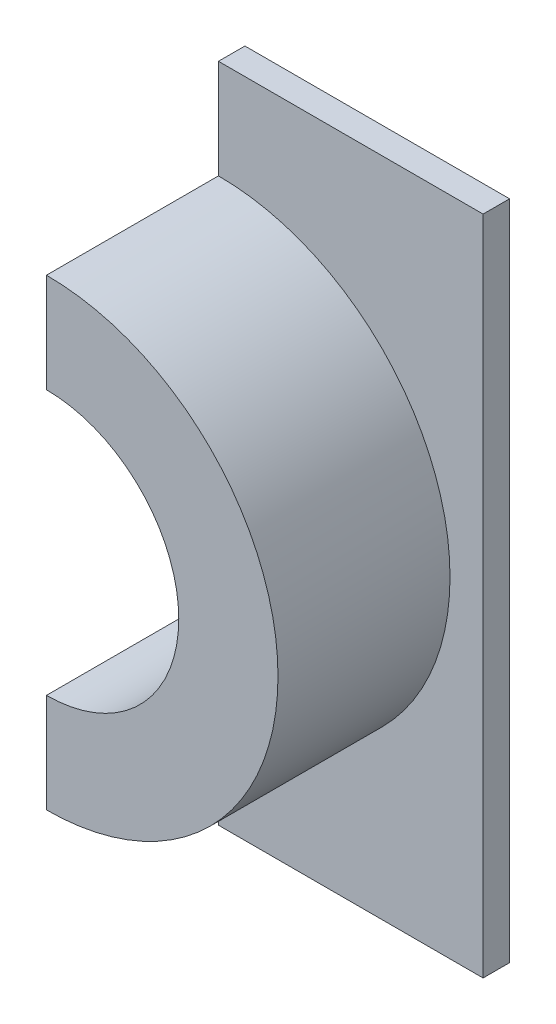
ISO-10303-21;
HEADER;
FILE_DESCRIPTION(('STEP AP214'),'2;1');
FILE_NAME('part.step','',(''),(''),'','','');
FILE_SCHEMA(('AUTOMOTIVE_DESIGN { 1 0 10303 214 1 1 1 1 }'));
ENDSEC;
DATA;
#1=APPLICATION_CONTEXT('core data for automotive mechanical design processes');
#2=APPLICATION_PROTOCOL_DEFINITION('international standard','automotive_design',2000,#1);
#3=PRODUCT_CONTEXT('',#1,'mechanical');
#4=PRODUCT('Part','Part','',(#3));
#5=PRODUCT_RELATED_PRODUCT_CATEGORY('part','',(#4));
#6=PRODUCT_DEFINITION_FORMATION('','',#4);
#7=PRODUCT_DEFINITION_CONTEXT('part definition',#1,'design');
#8=PRODUCT_DEFINITION('design','',#6,#7);
#9=PRODUCT_DEFINITION_SHAPE('','',#8);
#10=(LENGTH_UNIT() NAMED_UNIT(*) SI_UNIT(.MILLI.,.METRE.));
#11=(NAMED_UNIT(*) PLANE_ANGLE_UNIT() SI_UNIT($,.RADIAN.));
#12=(NAMED_UNIT(*) SI_UNIT($,.STERADIAN.) SOLID_ANGLE_UNIT());
#13=UNCERTAINTY_MEASURE_WITH_UNIT(LENGTH_MEASURE(1.E-05),#10,'distance_accuracy_value','');
#14=(GEOMETRIC_REPRESENTATION_CONTEXT(3) GLOBAL_UNCERTAINTY_ASSIGNED_CONTEXT((#13)) GLOBAL_UNIT_ASSIGNED_CONTEXT((#10,
#11,#12)) REPRESENTATION_CONTEXT('',''));
#15=CARTESIAN_POINT('',(0.,0.,0.));
#16=DIRECTION('',(0.,0.,1.));
#17=DIRECTION('',(1.,0.,0.));
#18=AXIS2_PLACEMENT_3D('',#15,#16,#17);
#19=CARTESIAN_POINT('',(-0.2,0.,0.04));
#20=DIRECTION('',(0.,0.,-1.));
#21=DIRECTION('',(-1.,0.,0.));
#22=AXIS2_PLACEMENT_3D('',#19,#20,#21);
#23=CYLINDRICAL_SURFACE('',#22,0.35);
#24=CARTESIAN_POINT('',(-0.2,0.,0.04));
#25=DIRECTION('',(0.,0.,-1.));
#26=DIRECTION('',(-1.,0.,0.));
#27=AXIS2_PLACEMENT_3D('',#24,#25,#26);
#28=CIRCLE('',#27,0.35);
#29=CARTESIAN_POINT('',(-0.2,0.35,0.04));
#30=VERTEX_POINT('',#29);
#31=CARTESIAN_POINT('',(-0.2,-0.35,0.04));
#32=VERTEX_POINT('',#31);
#33=EDGE_CURVE('E19',#30,#32,#28,.T.);
#34=ORIENTED_EDGE('',*,*,#33,.F.);
#35=DIRECTION('',(0.,0.,-1.));
#36=VECTOR('',#35,1.);
#37=CARTESIAN_POINT('',(-0.2,0.35,0.3));
#38=LINE('',#37,#36);
#39=CARTESIAN_POINT('',(-0.2,0.35,0.3));
#40=VERTEX_POINT('',#39);
#41=EDGE_CURVE('E116',#30,#40,#38,.F.);
#42=ORIENTED_EDGE('',*,*,#41,.T.);
#43=CARTESIAN_POINT('',(-0.2,0.,0.3));
#44=DIRECTION('',(0.,0.,-1.));
#45=DIRECTION('',(-1.,0.,0.));
#46=AXIS2_PLACEMENT_3D('',#43,#44,#45);
#47=CIRCLE('',#46,0.35);
#48=CARTESIAN_POINT('',(-0.2,-0.35,0.3));
#49=VERTEX_POINT('',#48);
#50=EDGE_CURVE('E93',#49,#40,#47,.F.);
#51=ORIENTED_EDGE('',*,*,#50,.F.);
#52=DIRECTION('',(0.,0.,-1.));
#53=VECTOR('',#52,1.);
#54=CARTESIAN_POINT('',(-0.2,-0.35,0.3));
#55=LINE('',#54,#53);
#56=EDGE_CURVE('E95',#49,#32,#55,.T.);
#57=ORIENTED_EDGE('',*,*,#56,.T.);
#58=EDGE_LOOP('',(#34,#42,#51,#57));
#59=FACE_BOUND('',#58,.T.);
#60=ADVANCED_FACE('F16',(#59),#23,.T.);
#61=CARTESIAN_POINT('',(-0.2,-0.5,0.04));
#62=DIRECTION('',(0.,0.,1.));
#63=DIRECTION('',(1.,0.,0.));
#64=AXIS2_PLACEMENT_3D('',#61,#62,#63);
#65=PLANE('',#64);
#66=DIRECTION('',(0.,1.,0.));
#67=VECTOR('',#66,1.);
#68=CARTESIAN_POINT('',(-0.2,0.35,0.04));
#69=LINE('',#68,#67);
#70=CARTESIAN_POINT('',(-0.2,-0.5,0.04));
#71=VERTEX_POINT('',#70);
#72=EDGE_CURVE('E91',#32,#71,#69,.F.);
#73=ORIENTED_EDGE('',*,*,#72,.T.);
#74=DIRECTION('',(1.,0.,0.));
#75=VECTOR('',#74,1.);
#76=CARTESIAN_POINT('',(-0.2,-0.5,0.04));
#77=LINE('',#76,#75);
#78=CARTESIAN_POINT('',(0.2,-0.5,0.04));
#79=VERTEX_POINT('',#78);
#80=EDGE_CURVE('E86',#71,#79,#77,.T.);
#81=ORIENTED_EDGE('',*,*,#80,.T.);
#82=DIRECTION('',(0.,1.,0.));
#83=VECTOR('',#82,1.);
#84=CARTESIAN_POINT('',(0.2,-0.35,0.04));
#85=LINE('',#84,#83);
#86=CARTESIAN_POINT('',(0.2,0.5,0.04));
#87=VERTEX_POINT('',#86);
#88=EDGE_CURVE('E126',#79,#87,#85,.T.);
#89=ORIENTED_EDGE('',*,*,#88,.T.);
#90=DIRECTION('',(1.,0.,0.));
#91=VECTOR('',#90,1.);
#92=CARTESIAN_POINT('',(0.2,0.5,0.04));
#93=LINE('',#92,#91);
#94=CARTESIAN_POINT('',(-0.2,0.5,0.04));
#95=VERTEX_POINT('',#94);
#96=EDGE_CURVE('E68',#87,#95,#93,.F.);
#97=ORIENTED_EDGE('',*,*,#96,.T.);
#98=DIRECTION('',(0.,1.,0.));
#99=VECTOR('',#98,1.);
#100=CARTESIAN_POINT('',(-0.2,0.35,0.04));
#101=LINE('',#100,#99);
#102=EDGE_CURVE('E92',#95,#30,#101,.F.);
#103=ORIENTED_EDGE('',*,*,#102,.T.);
#104=ORIENTED_EDGE('',*,*,#33,.T.);
#105=EDGE_LOOP('',(#73,#81,#89,#97,#103,#104));
#106=FACE_BOUND('',#105,.T.);
#107=ADVANCED_FACE('F90',(#106),#65,.T.);
#108=CARTESIAN_POINT('',(-0.2,-0.35,0.3));
#109=DIRECTION('',(0.,0.,1.));
#110=DIRECTION('',(1.,0.,0.));
#111=AXIS2_PLACEMENT_3D('',#108,#109,#110);
#112=PLANE('',#111);
#113=CARTESIAN_POINT('',(-0.2,0.,0.3));
#114=DIRECTION('',(0.,0.,1.));
#115=DIRECTION('',(1.,0.,0.));
#116=AXIS2_PLACEMENT_3D('',#113,#114,#115);
#117=CIRCLE('',#116,0.2);
#118=CARTESIAN_POINT('',(-0.2,0.2,0.3));
#119=VERTEX_POINT('',#118);
#120=CARTESIAN_POINT('',(-0.2,-0.2,0.3));
#121=VERTEX_POINT('',#120);
#122=EDGE_CURVE('E100',#119,#121,#117,.F.);
#123=ORIENTED_EDGE('',*,*,#122,.T.);
#124=DIRECTION('',(0.,1.,0.));
#125=VECTOR('',#124,1.);
#126=CARTESIAN_POINT('',(-0.2,0.35,0.3));
#127=LINE('',#126,#125);
#128=EDGE_CURVE('E106',#121,#49,#127,.F.);
#129=ORIENTED_EDGE('',*,*,#128,.T.);
#130=ORIENTED_EDGE('',*,*,#50,.T.);
#131=DIRECTION('',(0.,1.,0.));
#132=VECTOR('',#131,1.);
#133=CARTESIAN_POINT('',(-0.2,0.35,0.3));
#134=LINE('',#133,#132);
#135=EDGE_CURVE('E114',#40,#119,#134,.F.);
#136=ORIENTED_EDGE('',*,*,#135,.T.);
#137=EDGE_LOOP('',(#123,#129,#130,#136));
#138=FACE_BOUND('',#137,.T.);
#139=ADVANCED_FACE('F134',(#138),#112,.T.);
#140=CARTESIAN_POINT('',(-0.2,-0.5,0.04));
#141=DIRECTION('',(0.,1.,0.));
#142=DIRECTION('',(0.,0.,1.));
#143=AXIS2_PLACEMENT_3D('',#140,#141,#142);
#144=PLANE('',#143);
#145=DIRECTION('',(0.,0.,1.));
#146=VECTOR('',#145,1.);
#147=CARTESIAN_POINT('',(0.2,-0.5,0.3));
#148=LINE('',#147,#146);
#149=CARTESIAN_POINT('',(0.2,-0.5,0.));
#150=VERTEX_POINT('',#149);
#151=EDGE_CURVE('E109',#150,#79,#148,.T.);
#152=ORIENTED_EDGE('',*,*,#151,.T.);
#153=ORIENTED_EDGE('',*,*,#80,.F.);
#154=DIRECTION('',(0.,0.,-1.));
#155=VECTOR('',#154,1.);
#156=CARTESIAN_POINT('',(-0.2,-0.5,0.3));
#157=LINE('',#156,#155);
#158=CARTESIAN_POINT('',(-0.2,-0.5,0.));
#159=VERTEX_POINT('',#158);
#160=EDGE_CURVE('E97',#71,#159,#157,.T.);
#161=ORIENTED_EDGE('',*,*,#160,.T.);
#162=DIRECTION('',(1.,0.,0.));
#163=VECTOR('',#162,1.);
#164=CARTESIAN_POINT('',(-0.2,-0.5,0.));
#165=LINE('',#164,#163);
#166=EDGE_CURVE('E165',#159,#150,#165,.T.);
#167=ORIENTED_EDGE('',*,*,#166,.T.);
#168=EDGE_LOOP('',(#152,#153,#161,#167));
#169=FACE_BOUND('',#168,.T.);
#170=ADVANCED_FACE('F170',(#169),#144,.F.);
#171=CARTESIAN_POINT('',(0.2,-0.35,0.3));
#172=DIRECTION('',(-1.,0.,0.));
#173=DIRECTION('',(0.,0.,1.));
#174=AXIS2_PLACEMENT_3D('',#171,#172,#173);
#175=PLANE('',#174);
#176=ORIENTED_EDGE('',*,*,#88,.F.);
#177=ORIENTED_EDGE('',*,*,#151,.F.);
#178=DIRECTION('',(0.,1.,0.));
#179=VECTOR('',#178,1.);
#180=CARTESIAN_POINT('',(0.2,-0.35,0.));
#181=LINE('',#180,#179);
#182=CARTESIAN_POINT('',(0.2,0.5,0.));
#183=VERTEX_POINT('',#182);
#184=EDGE_CURVE('E156',#150,#183,#181,.T.);
#185=ORIENTED_EDGE('',*,*,#184,.T.);
#186=DIRECTION('',(0.,0.,-1.));
#187=VECTOR('',#186,1.);
#188=CARTESIAN_POINT('',(0.2,0.5,0.04));
#189=LINE('',#188,#187);
#190=EDGE_CURVE('E123',#183,#87,#189,.F.);
#191=ORIENTED_EDGE('',*,*,#190,.T.);
#192=EDGE_LOOP('',(#176,#177,#185,#191));
#193=FACE_BOUND('',#192,.T.);
#194=ADVANCED_FACE('F175',(#193),#175,.F.);
#195=CARTESIAN_POINT('',(0.2,0.5,0.04));
#196=DIRECTION('',(0.,-1.,0.));
#197=DIRECTION('',(0.,0.,-1.));
#198=AXIS2_PLACEMENT_3D('',#195,#196,#197);
#199=PLANE('',#198);
#200=DIRECTION('',(0.,0.,-1.));
#201=VECTOR('',#200,1.);
#202=CARTESIAN_POINT('',(-0.2,0.5,0.3));
#203=LINE('',#202,#201);
#204=CARTESIAN_POINT('',(-0.2,0.5,0.));
#205=VERTEX_POINT('',#204);
#206=EDGE_CURVE('E119',#205,#95,#203,.F.);
#207=ORIENTED_EDGE('',*,*,#206,.T.);
#208=ORIENTED_EDGE('',*,*,#96,.F.);
#209=ORIENTED_EDGE('',*,*,#190,.F.);
#210=DIRECTION('',(1.,0.,0.));
#211=VECTOR('',#210,1.);
#212=CARTESIAN_POINT('',(-0.2,0.5,0.));
#213=LINE('',#212,#211);
#214=EDGE_CURVE('E153',#183,#205,#213,.F.);
#215=ORIENTED_EDGE('',*,*,#214,.T.);
#216=EDGE_LOOP('',(#207,#208,#209,#215));
#217=FACE_BOUND('',#216,.T.);
#218=ADVANCED_FACE('F180',(#217),#199,.F.);
#219=CARTESIAN_POINT('',(-0.2,0.35,0.3));
#220=DIRECTION('',(1.,0.,0.));
#221=DIRECTION('',(0.,0.,-1.));
#222=AXIS2_PLACEMENT_3D('',#219,#220,#221);
#223=PLANE('',#222);
#224=DIRECTION('',(0.,0.,1.));
#225=VECTOR('',#224,1.);
#226=CARTESIAN_POINT('',(-0.2,0.2,1.20415945787923));
#227=LINE('',#226,#225);
#228=CARTESIAN_POINT('',(-0.2,0.2,0.));
#229=VERTEX_POINT('',#228);
#230=EDGE_CURVE('E102',#229,#119,#227,.T.);
#231=ORIENTED_EDGE('',*,*,#230,.T.);
#232=ORIENTED_EDGE('',*,*,#135,.F.);
#233=ORIENTED_EDGE('',*,*,#41,.F.);
#234=ORIENTED_EDGE('',*,*,#102,.F.);
#235=ORIENTED_EDGE('',*,*,#206,.F.);
#236=DIRECTION('',(0.,1.,0.));
#237=VECTOR('',#236,1.);
#238=CARTESIAN_POINT('',(-0.2,-0.35,0.));
#239=LINE('',#238,#237);
#240=EDGE_CURVE('E131',#205,#229,#239,.F.);
#241=ORIENTED_EDGE('',*,*,#240,.T.);
#242=EDGE_LOOP('',(#231,#232,#233,#234,#235,#241));
#243=FACE_BOUND('',#242,.T.);
#244=ADVANCED_FACE('F138',(#243),#223,.F.);
#245=CARTESIAN_POINT('',(-0.2,0.,1.20415945787923));
#246=DIRECTION('',(0.,0.,1.));
#247=DIRECTION('',(1.,0.,0.));
#248=AXIS2_PLACEMENT_3D('',#245,#246,#247);
#249=CYLINDRICAL_SURFACE('',#248,0.2);
#250=ORIENTED_EDGE('',*,*,#230,.F.);
#251=CARTESIAN_POINT('',(-0.2,0.,0.));
#252=DIRECTION('',(0.,0.,1.));
#253=DIRECTION('',(1.,0.,0.));
#254=AXIS2_PLACEMENT_3D('',#251,#252,#253);
#255=CIRCLE('',#254,0.2);
#256=CARTESIAN_POINT('',(-0.2,-0.2,0.));
#257=VERTEX_POINT('',#256);
#258=EDGE_CURVE('E25',#229,#257,#255,.F.);
#259=ORIENTED_EDGE('',*,*,#258,.T.);
#260=DIRECTION('',(0.,0.,-1.));
#261=VECTOR('',#260,1.);
#262=CARTESIAN_POINT('',(-0.2,-0.2,0.3));
#263=LINE('',#262,#261);
#264=EDGE_CURVE('E33',#257,#121,#263,.F.);
#265=ORIENTED_EDGE('',*,*,#264,.T.);
#266=ORIENTED_EDGE('',*,*,#122,.F.);
#267=EDGE_LOOP('',(#250,#259,#265,#266));
#268=FACE_BOUND('',#267,.T.);
#269=ADVANCED_FACE('F188',(#268),#249,.F.);
#270=CARTESIAN_POINT('',(-0.2,0.35,0.3));
#271=DIRECTION('',(1.,0.,0.));
#272=DIRECTION('',(0.,0.,-1.));
#273=AXIS2_PLACEMENT_3D('',#270,#271,#272);
#274=PLANE('',#273);
#275=ORIENTED_EDGE('',*,*,#264,.F.);
#276=DIRECTION('',(0.,1.,0.));
#277=VECTOR('',#276,1.);
#278=CARTESIAN_POINT('',(-0.2,-0.35,0.));
#279=LINE('',#278,#277);
#280=EDGE_CURVE('E11',#257,#159,#279,.F.);
#281=ORIENTED_EDGE('',*,*,#280,.T.);
#282=ORIENTED_EDGE('',*,*,#160,.F.);
#283=ORIENTED_EDGE('',*,*,#72,.F.);
#284=ORIENTED_EDGE('',*,*,#56,.F.);
#285=ORIENTED_EDGE('',*,*,#128,.F.);
#286=EDGE_LOOP('',(#275,#281,#282,#283,#284,#285));
#287=FACE_BOUND('',#286,.T.);
#288=ADVANCED_FACE('F94',(#287),#274,.F.);
#289=CARTESIAN_POINT('',(-0.2,-0.35,0.));
#290=DIRECTION('',(0.,0.,1.));
#291=DIRECTION('',(1.,0.,0.));
#292=AXIS2_PLACEMENT_3D('',#289,#290,#291);
#293=PLANE('',#292);
#294=ORIENTED_EDGE('',*,*,#258,.F.);
#295=ORIENTED_EDGE('',*,*,#240,.F.);
#296=ORIENTED_EDGE('',*,*,#214,.F.);
#297=ORIENTED_EDGE('',*,*,#184,.F.);
#298=ORIENTED_EDGE('',*,*,#166,.F.);
#299=ORIENTED_EDGE('',*,*,#280,.F.);
#300=EDGE_LOOP('',(#294,#295,#296,#297,#298,#299));
#301=FACE_BOUND('',#300,.T.);
#302=ADVANCED_FACE('F178',(#301),#293,.F.);
#303=CLOSED_SHELL('',(#60,#107,#139,#170,#194,#218,#244,#269,#288,#302));
#304=MANIFOLD_SOLID_BREP('B1',#303);
#305=ADVANCED_BREP_SHAPE_REPRESENTATION('',(#18,#304),#14);
#306=SHAPE_DEFINITION_REPRESENTATION(#9,#305);
ENDSEC;
END-ISO-10303-21;
